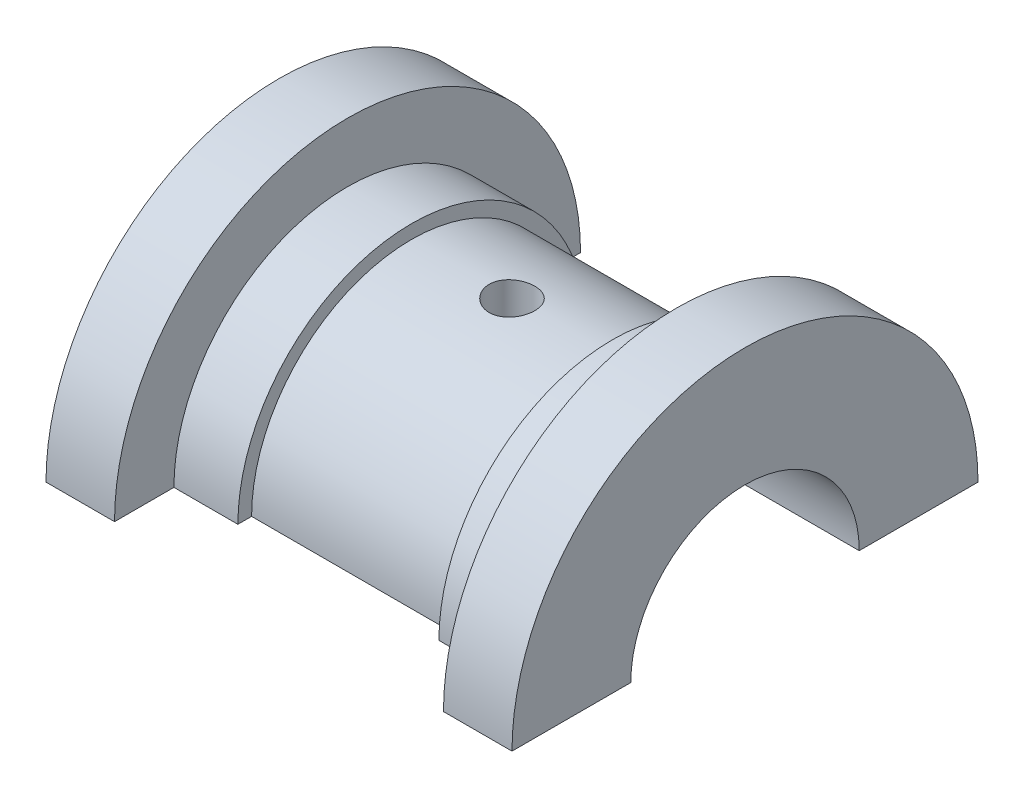
ISO-10303-21;
HEADER;
FILE_DESCRIPTION(('STEP AP214'),'2;1');
FILE_NAME('part.step','',(''),(''),'','','');
FILE_SCHEMA(('AUTOMOTIVE_DESIGN { 1 0 10303 214 1 1 1 1 }'));
ENDSEC;
DATA;
#1=APPLICATION_CONTEXT('core data for automotive mechanical design processes');
#2=APPLICATION_PROTOCOL_DEFINITION('international standard','automotive_design',2000,#1);
#3=PRODUCT_CONTEXT('',#1,'mechanical');
#4=PRODUCT('Part','Part','',(#3));
#5=PRODUCT_RELATED_PRODUCT_CATEGORY('part','',(#4));
#6=PRODUCT_DEFINITION_FORMATION('','',#4);
#7=PRODUCT_DEFINITION_CONTEXT('part definition',#1,'design');
#8=PRODUCT_DEFINITION('design','',#6,#7);
#9=PRODUCT_DEFINITION_SHAPE('','',#8);
#10=(LENGTH_UNIT() NAMED_UNIT(*) SI_UNIT(.MILLI.,.METRE.));
#11=(NAMED_UNIT(*) PLANE_ANGLE_UNIT() SI_UNIT($,.RADIAN.));
#12=(NAMED_UNIT(*) SI_UNIT($,.STERADIAN.) SOLID_ANGLE_UNIT());
#13=UNCERTAINTY_MEASURE_WITH_UNIT(LENGTH_MEASURE(1.E-05),#10,'distance_accuracy_value','');
#14=(GEOMETRIC_REPRESENTATION_CONTEXT(3) GLOBAL_UNCERTAINTY_ASSIGNED_CONTEXT((#13)) GLOBAL_UNIT_ASSIGNED_CONTEXT((#10,
#11,#12)) REPRESENTATION_CONTEXT('',''));
#15=CARTESIAN_POINT('',(0.,0.,0.));
#16=DIRECTION('',(0.,0.,1.));
#17=DIRECTION('',(1.,0.,0.));
#18=AXIS2_PLACEMENT_3D('',#15,#16,#17);
#19=CARTESIAN_POINT('',(25.5,0.,12.5));
#20=DIRECTION('',(-1.,0.,0.));
#21=DIRECTION('',(0.,0.,1.));
#22=AXIS2_PLACEMENT_3D('',#19,#20,#21);
#23=PLANE('',#22);
#24=CARTESIAN_POINT('',(25.5,0.,0.));
#25=DIRECTION('',(-1.,0.,0.));
#26=DIRECTION('',(0.,0.,1.));
#27=AXIS2_PLACEMENT_3D('',#24,#25,#26);
#28=CIRCLE('',#27,25.5);
#29=CARTESIAN_POINT('',(25.5,0.,25.5));
#30=VERTEX_POINT('',#29);
#31=CARTESIAN_POINT('',(25.5,0.,-25.5));
#32=VERTEX_POINT('',#31);
#33=EDGE_CURVE('E45',#30,#32,#28,.T.);
#34=ORIENTED_EDGE('',*,*,#33,.F.);
#35=DIRECTION('',(0.,0.,1.));
#36=VECTOR('',#35,1.);
#37=CARTESIAN_POINT('',(25.5,0.,12.5));
#38=LINE('',#37,#36);
#39=CARTESIAN_POINT('',(25.5,0.,12.5));
#40=VERTEX_POINT('',#39);
#41=EDGE_CURVE('E176',#40,#30,#38,.T.);
#42=ORIENTED_EDGE('',*,*,#41,.F.);
#43=CARTESIAN_POINT('',(25.5,0.,0.));
#44=DIRECTION('',(-1.,0.,0.));
#45=DIRECTION('',(0.,0.,1.));
#46=AXIS2_PLACEMENT_3D('',#43,#44,#45);
#47=CIRCLE('',#46,12.5);
#48=CARTESIAN_POINT('',(25.5,0.,-12.5));
#49=VERTEX_POINT('',#48);
#50=EDGE_CURVE('E52',#40,#49,#47,.T.);
#51=ORIENTED_EDGE('',*,*,#50,.T.);
#52=DIRECTION('',(0.,0.,-1.));
#53=VECTOR('',#52,1.);
#54=CARTESIAN_POINT('',(25.5,0.,-12.5));
#55=LINE('',#54,#53);
#56=EDGE_CURVE('E138',#49,#32,#55,.T.);
#57=ORIENTED_EDGE('',*,*,#56,.T.);
#58=EDGE_LOOP('',(#34,#42,#51,#57));
#59=FACE_BOUND('',#58,.T.);
#60=ADVANCED_FACE('F33',(#59),#23,.F.);
#61=CARTESIAN_POINT('',(0.,0.,0.));
#62=DIRECTION('',(-1.,0.,0.));
#63=DIRECTION('',(0.,0.,1.));
#64=AXIS2_PLACEMENT_3D('',#61,#62,#63);
#65=CYLINDRICAL_SURFACE('',#64,25.5);
#66=CARTESIAN_POINT('',(18.,0.,0.));
#67=DIRECTION('',(-1.,0.,0.));
#68=DIRECTION('',(0.,0.,1.));
#69=AXIS2_PLACEMENT_3D('',#66,#67,#68);
#70=CIRCLE('',#69,25.5);
#71=CARTESIAN_POINT('',(18.,0.,25.5));
#72=VERTEX_POINT('',#71);
#73=CARTESIAN_POINT('',(18.,0.,-25.5));
#74=VERTEX_POINT('',#73);
#75=EDGE_CURVE('E136',#72,#74,#70,.T.);
#76=ORIENTED_EDGE('',*,*,#75,.F.);
#77=DIRECTION('',(-1.,0.,0.));
#78=VECTOR('',#77,1.);
#79=CARTESIAN_POINT('',(25.5,0.,25.5));
#80=LINE('',#79,#78);
#81=EDGE_CURVE('E133',#30,#72,#80,.T.);
#82=ORIENTED_EDGE('',*,*,#81,.F.);
#83=ORIENTED_EDGE('',*,*,#33,.T.);
#84=DIRECTION('',(-1.,0.,0.));
#85=VECTOR('',#84,1.);
#86=CARTESIAN_POINT('',(25.5,0.,-25.5));
#87=LINE('',#86,#85);
#88=EDGE_CURVE('E130',#32,#74,#87,.T.);
#89=ORIENTED_EDGE('',*,*,#88,.T.);
#90=EDGE_LOOP('',(#76,#82,#83,#89));
#91=FACE_BOUND('',#90,.T.);
#92=ADVANCED_FACE('F35',(#91),#65,.T.);
#93=CARTESIAN_POINT('',(18.,0.,25.5));
#94=DIRECTION('',(1.,0.,0.));
#95=DIRECTION('',(0.,0.,-1.));
#96=AXIS2_PLACEMENT_3D('',#93,#94,#95);
#97=PLANE('',#96);
#98=CARTESIAN_POINT('',(18.,0.,0.));
#99=DIRECTION('',(-1.,0.,0.));
#100=DIRECTION('',(0.,0.,1.));
#101=AXIS2_PLACEMENT_3D('',#98,#99,#100);
#102=CIRCLE('',#101,19.);
#103=CARTESIAN_POINT('',(18.,0.,19.));
#104=VERTEX_POINT('',#103);
#105=CARTESIAN_POINT('',(18.,0.,-19.));
#106=VERTEX_POINT('',#105);
#107=EDGE_CURVE('E224',#104,#106,#102,.T.);
#108=ORIENTED_EDGE('',*,*,#107,.F.);
#109=DIRECTION('',(0.,0.,-1.));
#110=VECTOR('',#109,1.);
#111=CARTESIAN_POINT('',(18.,0.,25.5));
#112=LINE('',#111,#110);
#113=EDGE_CURVE('E179',#72,#104,#112,.T.);
#114=ORIENTED_EDGE('',*,*,#113,.F.);
#115=ORIENTED_EDGE('',*,*,#75,.T.);
#116=DIRECTION('',(0.,0.,1.));
#117=VECTOR('',#116,1.);
#118=CARTESIAN_POINT('',(18.,0.,-25.5));
#119=LINE('',#118,#117);
#120=EDGE_CURVE('E146',#74,#106,#119,.T.);
#121=ORIENTED_EDGE('',*,*,#120,.T.);
#122=EDGE_LOOP('',(#108,#114,#115,#121));
#123=FACE_BOUND('',#122,.T.);
#124=ADVANCED_FACE('F228',(#123),#97,.F.);
#125=CARTESIAN_POINT('',(0.,0.,0.));
#126=DIRECTION('',(-1.,0.,0.));
#127=DIRECTION('',(0.,0.,1.));
#128=AXIS2_PLACEMENT_3D('',#125,#126,#127);
#129=CYLINDRICAL_SURFACE('',#128,19.);
#130=CARTESIAN_POINT('',(11.,0.,0.));
#131=DIRECTION('',(-1.,0.,0.));
#132=DIRECTION('',(0.,0.,1.));
#133=AXIS2_PLACEMENT_3D('',#130,#131,#132);
#134=CIRCLE('',#133,19.);
#135=CARTESIAN_POINT('',(11.,0.,19.));
#136=VERTEX_POINT('',#135);
#137=CARTESIAN_POINT('',(11.,0.,-19.));
#138=VERTEX_POINT('',#137);
#139=EDGE_CURVE('E222',#136,#138,#134,.T.);
#140=ORIENTED_EDGE('',*,*,#139,.F.);
#141=DIRECTION('',(-1.,0.,0.));
#142=VECTOR('',#141,1.);
#143=CARTESIAN_POINT('',(18.,0.,19.));
#144=LINE('',#143,#142);
#145=EDGE_CURVE('E182',#104,#136,#144,.T.);
#146=ORIENTED_EDGE('',*,*,#145,.F.);
#147=ORIENTED_EDGE('',*,*,#107,.T.);
#148=DIRECTION('',(-1.,0.,0.));
#149=VECTOR('',#148,1.);
#150=CARTESIAN_POINT('',(18.,0.,-19.));
#151=LINE('',#150,#149);
#152=EDGE_CURVE('E148',#106,#138,#151,.T.);
#153=ORIENTED_EDGE('',*,*,#152,.T.);
#154=EDGE_LOOP('',(#140,#146,#147,#153));
#155=FACE_BOUND('',#154,.T.);
#156=ADVANCED_FACE('F260',(#155),#129,.T.);
#157=CARTESIAN_POINT('',(11.,0.,19.));
#158=DIRECTION('',(1.,0.,0.));
#159=DIRECTION('',(0.,0.,-1.));
#160=AXIS2_PLACEMENT_3D('',#157,#158,#159);
#161=PLANE('',#160);
#162=CARTESIAN_POINT('',(11.,0.,0.));
#163=DIRECTION('',(-1.,0.,0.));
#164=DIRECTION('',(0.,0.,1.));
#165=AXIS2_PLACEMENT_3D('',#162,#163,#164);
#166=CIRCLE('',#165,17.5);
#167=CARTESIAN_POINT('',(11.,0.,17.5));
#168=VERTEX_POINT('',#167);
#169=CARTESIAN_POINT('',(11.,0.,-17.5));
#170=VERTEX_POINT('',#169);
#171=EDGE_CURVE('E220',#168,#170,#166,.T.);
#172=ORIENTED_EDGE('',*,*,#171,.F.);
#173=DIRECTION('',(0.,0.,-1.));
#174=VECTOR('',#173,1.);
#175=CARTESIAN_POINT('',(11.,0.,19.));
#176=LINE('',#175,#174);
#177=EDGE_CURVE('E185',#136,#168,#176,.T.);
#178=ORIENTED_EDGE('',*,*,#177,.F.);
#179=ORIENTED_EDGE('',*,*,#139,.T.);
#180=DIRECTION('',(0.,0.,1.));
#181=VECTOR('',#180,1.);
#182=CARTESIAN_POINT('',(11.,0.,-19.));
#183=LINE('',#182,#181);
#184=EDGE_CURVE('E154',#138,#170,#183,.T.);
#185=ORIENTED_EDGE('',*,*,#184,.T.);
#186=EDGE_LOOP('',(#172,#178,#179,#185));
#187=FACE_BOUND('',#186,.T.);
#188=ADVANCED_FACE('F258',(#187),#161,.F.);
#189=CARTESIAN_POINT('',(0.,0.,0.));
#190=DIRECTION('',(-1.,0.,0.));
#191=DIRECTION('',(0.,0.,1.));
#192=AXIS2_PLACEMENT_3D('',#189,#190,#191);
#193=CYLINDRICAL_SURFACE('',#192,17.5);
#194=CARTESIAN_POINT('',(0.,17.3205080756888,2.49999999999999));
#195=CARTESIAN_POINT('',(-0.139655214050539,17.3205103214296,2.49999417644979));
#196=CARTESIAN_POINT('',(-0.279393390965434,17.3222153996634,2.48825830633599));
#197=CARTESIAN_POINT('',(-0.554968295528884,17.3288474891277,2.44163425172346));
#198=CARTESIAN_POINT('',(-0.690800994393875,17.3337777110364,2.40672299527127));
#199=CARTESIAN_POINT('',(-0.954535875036128,17.346290533042,2.31480923545586));
#200=CARTESIAN_POINT('',(-1.08244384762566,17.3538711688453,2.25782308902599));
#201=CARTESIAN_POINT('',(-1.32686216183505,17.3708283324759,2.12341469861512));
#202=CARTESIAN_POINT('',(-1.44337418380036,17.3802045949313,2.04599547375905));
#203=CARTESIAN_POINT('',(-1.66256036980916,17.3997728156945,1.87231683550245));
#204=CARTESIAN_POINT('',(-1.76513964233235,17.4099696809091,1.77593820534161));
#205=CARTESIAN_POINT('',(-1.95272694655072,17.4299862889805,1.56733384870893));
#206=CARTESIAN_POINT('',(-2.03773404080033,17.4398060116945,1.4551072773139));
#207=CARTESIAN_POINT('',(-2.1881113721996,17.4580129627861,1.21738798002561));
#208=CARTESIAN_POINT('',(-2.25339464314803,17.4663937786684,1.09183970777011));
#209=CARTESIAN_POINT('',(-2.36191341915977,17.4807243931613,0.831420932453866));
#210=CARTESIAN_POINT('',(-2.40514998330923,17.4866743085456,0.696550877549158));
#211=CARTESIAN_POINT('',(-2.46806150870533,17.4954381251123,0.422292579426186));
#212=CARTESIAN_POINT('',(-2.48789508745779,17.4982731289764,0.282941406337346));
#213=CARTESIAN_POINT('',(-2.50392987320824,17.5005599435479,0.00286195659799773));
#214=CARTESIAN_POINT('',(-2.50013227745763,17.5000119256529,-0.137866249925724));
#215=CARTESIAN_POINT('',(-2.46913827723022,17.4956113682908,-0.415623740232337));
#216=CARTESIAN_POINT('',(-2.44211250139685,17.4917829266554,-0.552672499713792));
#217=CARTESIAN_POINT('',(-2.36569680037598,17.4812785676579,-0.820269493910865));
#218=CARTESIAN_POINT('',(-2.31630634376524,17.4746025826336,-0.950817574077351));
#219=CARTESIAN_POINT('',(-2.19638656902053,17.4591117546373,-1.20222745845967));
#220=CARTESIAN_POINT('',(-2.12578481110144,17.4502896021464,-1.32305424098883));
#221=CARTESIAN_POINT('',(-1.96549938407466,17.4314908337029,-1.55120977517205));
#222=CARTESIAN_POINT('',(-1.87581457419597,17.4215141487494,-1.65853771926478));
#223=CARTESIAN_POINT('',(-1.678956747905,17.4014150617975,-1.85765373882982));
#224=CARTESIAN_POINT('',(-1.5716348340635,17.3912921538904,-1.94929461665229));
#225=CARTESIAN_POINT('',(-1.34305684821314,17.3721286734458,-2.11328736987653));
#226=CARTESIAN_POINT('',(-1.22180070481798,17.3630881064538,-2.18563914645222));
#227=CARTESIAN_POINT('',(-0.968649637617271,17.3471131710366,-2.30901626900993));
#228=CARTESIAN_POINT('',(-0.836747742646741,17.3401801971233,-2.36002750314722));
#229=CARTESIAN_POINT('',(-0.566128025217638,17.3292308226119,-2.43913279635399));
#230=CARTESIAN_POINT('',(-0.427410637010545,17.3252142364516,-2.46722831350377));
#231=CARTESIAN_POINT('',(-0.148404328212449,17.3205872594665,-2.49950488360241));
#232=CARTESIAN_POINT('',(-0.00813996750551849,17.3199472150388,-2.50389413880589));
#233=CARTESIAN_POINT('',(0.271122256281439,17.3220671566589,-2.489185103089));
#234=CARTESIAN_POINT('',(0.410120154779111,17.3248270473289,-2.47008747104211));
#235=CARTESIAN_POINT('',(0.682265225035557,17.3334087065645,-2.40912297319001));
#236=CARTESIAN_POINT('',(0.815435908831675,17.3392166418156,-2.36735894805525));
#237=CARTESIAN_POINT('',(1.07288599682062,17.3532286401521,-2.26235382714328));
#238=CARTESIAN_POINT('',(1.19716499945215,17.3614328113701,-2.19911176212675));
#239=CARTESIAN_POINT('',(1.43423984965186,17.3793831051677,-2.05244200414031));
#240=CARTESIAN_POINT('',(1.54695120151544,17.3891394056538,-1.96887900033905));
#241=CARTESIAN_POINT('',(1.75682465453188,17.4090636358241,-1.78412847276705));
#242=CARTESIAN_POINT('',(1.8539859600739,17.4192315865368,-1.6829400477527));
#243=CARTESIAN_POINT('',(2.03074402304224,17.4389256551739,-1.46489635785668));
#244=CARTESIAN_POINT('',(2.1102031528994,17.4484463695232,-1.3479289651554));
#245=CARTESIAN_POINT('',(2.24834445391964,17.4656902694975,-1.10218588096399));
#246=CARTESIAN_POINT('',(2.30702714967243,17.4734135005061,-0.973410487720562));
#247=CARTESIAN_POINT('',(2.40172764289464,17.4861684730555,-0.70814490574241));
#248=CARTESIAN_POINT('',(2.43782198578435,17.4912092957152,-0.571682498904907));
#249=CARTESIAN_POINT('',(2.48656933388325,17.4980694889566,-0.294556573807227));
#250=CARTESIAN_POINT('',(2.4992237373173,17.4998890516906,-0.153893306642842));
#251=CARTESIAN_POINT('',(2.50070029868058,17.5001000958988,0.126303913283945));
#252=CARTESIAN_POINT('',(2.48973352377306,17.4985219377795,0.26583677718822));
#253=CARTESIAN_POINT('',(2.44472981244618,17.4921758034385,0.54105329184985));
#254=CARTESIAN_POINT('',(2.41069293049507,17.4874078347479,0.676736951694341));
#255=CARTESIAN_POINT('',(2.32058752821483,17.4752152756766,0.940354643121522));
#256=CARTESIAN_POINT('',(2.26453227439437,17.4677922852398,1.06829328775858));
#257=CARTESIAN_POINT('',(2.13200356349716,17.4511070012847,1.31298213231449));
#258=CARTESIAN_POINT('',(2.05552956867623,17.4418446593271,1.42973203745873));
#259=CARTESIAN_POINT('',(1.88356535597191,17.4224130932707,1.64980243700276));
#260=CARTESIAN_POINT('',(1.78791886646362,17.4122368231533,1.75300020789776));
#261=CARTESIAN_POINT('',(1.58065304970162,17.3921777929122,1.94195895909258));
#262=CARTESIAN_POINT('',(1.46902997123846,17.3822951023791,2.02771583289178));
#263=CARTESIAN_POINT('',(1.23231820209395,17.3638885978291,2.17974404343877));
#264=CARTESIAN_POINT('',(1.10716413704061,17.3553719241531,2.24591442873637));
#265=CARTESIAN_POINT('',(0.847459629299104,17.3407453505435,2.35619878131272));
#266=CARTESIAN_POINT('',(0.712919252117546,17.3346329177213,2.40033597402072));
#267=CARTESIAN_POINT('',(0.481454467704518,17.3269411528972,2.45511568957329));
#268=CARTESIAN_POINT('',(0.385969580734812,17.3245412999151,2.47192203162012));
#269=CARTESIAN_POINT('',(0.19366975379469,17.3213239914062,2.49436614385581));
#270=CARTESIAN_POINT('',(0.096854828692965,17.3205065182042,2.50000403879625));
#271=CARTESIAN_POINT('',(0.,17.3205080756888,2.49999999999999));
#272=B_SPLINE_CURVE_WITH_KNOTS('',3,(#194,#195,#196,#197,#198,#199,#200,#201,#202,#203,#204,
#205,#206,#207,#208,#209,#210,#211,#212,#213,#214,#215,#216,#217,#218,#219,#220,#221,#222,#223,
#224,#225,#226,#227,#228,#229,#230,#231,#232,#233,#234,#235,#236,#237,#238,#239,#240,#241,#242,
#243,#244,#245,#246,#247,#248,#249,#250,#251,#252,#253,#254,#255,#256,#257,#258,#259,#260,#261,
#262,#263,#264,#265,#266,#267,#268,#269,#270,#271),.UNSPECIFIED.,.T.,.F.,(4,2,2,2,2,2,2,2,2,2,2,
2,2,2,2,2,2,2,2,2,2,2,2,2,2,2,2,2,2,2,2,2,2,2,2,2,2,2,4),(0.,0.418611686761215,
0.837640743157848,1.25635990174198,1.67501722635384,2.09639644561274,2.5177981389317,
2.94103163345003,3.36424479463774,3.78457277673271,4.20487946347622,4.622124811343,
5.03938007419637,5.45807684551731,5.87679865326297,6.29925647482801,6.72171646077844,
7.14445536663834,7.56716737238591,7.98616076353196,8.40514240099878,8.82223876005369,
9.23935394391402,9.65932651264325,10.0793205622075,10.502474019027,10.9256167907707,
11.3473177767363,11.7689936068437,12.1869171913008,12.6048397890487,13.022510965389,
13.4401931425248,13.8614293663582,14.2827646567286,14.7062351939403,15.1292583986303,
15.4195806495843,15.7098996576198),.UNSPECIFIED.);
#273=CARTESIAN_POINT('',(0.,17.3205080756888,2.49999999999999));
#274=VERTEX_POINT('',#273);
#275=EDGE_CURVE('E11',#274,#274,#272,.T.);
#276=ORIENTED_EDGE('',*,*,#275,.T.);
#277=EDGE_LOOP('',(#276));
#278=FACE_BOUND('',#277,.T.);
#279=CARTESIAN_POINT('',(-11.,0.,0.));
#280=DIRECTION('',(-1.,0.,0.));
#281=DIRECTION('',(0.,0.,1.));
#282=AXIS2_PLACEMENT_3D('',#279,#280,#281);
#283=CIRCLE('',#282,17.5);
#284=CARTESIAN_POINT('',(-11.,0.,17.5));
#285=VERTEX_POINT('',#284);
#286=CARTESIAN_POINT('',(-11.,0.,-17.5));
#287=VERTEX_POINT('',#286);
#288=EDGE_CURVE('E218',#285,#287,#283,.T.);
#289=ORIENTED_EDGE('',*,*,#288,.F.);
#290=DIRECTION('',(-1.,0.,0.));
#291=VECTOR('',#290,1.);
#292=CARTESIAN_POINT('',(11.,0.,17.5));
#293=LINE('',#292,#291);
#294=EDGE_CURVE('E188',#168,#285,#293,.T.);
#295=ORIENTED_EDGE('',*,*,#294,.F.);
#296=ORIENTED_EDGE('',*,*,#171,.T.);
#297=DIRECTION('',(-1.,0.,0.));
#298=VECTOR('',#297,1.);
#299=CARTESIAN_POINT('',(11.,0.,-17.5));
#300=LINE('',#299,#298);
#301=EDGE_CURVE('E157',#170,#287,#300,.T.);
#302=ORIENTED_EDGE('',*,*,#301,.T.);
#303=EDGE_LOOP('',(#289,#295,#296,#302));
#304=FACE_BOUND('',#303,.T.);
#305=ADVANCED_FACE('F255',(#278,#304),#193,.T.);
#306=CARTESIAN_POINT('',(-11.,0.,19.));
#307=DIRECTION('',(-1.,0.,0.));
#308=DIRECTION('',(0.,0.,1.));
#309=AXIS2_PLACEMENT_3D('',#306,#307,#308);
#310=PLANE('',#309);
#311=CARTESIAN_POINT('',(-11.,0.,0.));
#312=DIRECTION('',(-1.,0.,0.));
#313=DIRECTION('',(0.,0.,1.));
#314=AXIS2_PLACEMENT_3D('',#311,#312,#313);
#315=CIRCLE('',#314,19.);
#316=CARTESIAN_POINT('',(-11.,0.,19.));
#317=VERTEX_POINT('',#316);
#318=CARTESIAN_POINT('',(-11.,0.,-19.));
#319=VERTEX_POINT('',#318);
#320=EDGE_CURVE('E216',#317,#319,#315,.T.);
#321=ORIENTED_EDGE('',*,*,#320,.F.);
#322=DIRECTION('',(0.,0.,1.));
#323=VECTOR('',#322,1.);
#324=CARTESIAN_POINT('',(-11.,0.,19.));
#325=LINE('',#324,#323);
#326=EDGE_CURVE('E191',#285,#317,#325,.T.);
#327=ORIENTED_EDGE('',*,*,#326,.F.);
#328=ORIENTED_EDGE('',*,*,#288,.T.);
#329=DIRECTION('',(0.,0.,-1.));
#330=VECTOR('',#329,1.);
#331=CARTESIAN_POINT('',(-11.,0.,-19.));
#332=LINE('',#331,#330);
#333=EDGE_CURVE('E160',#287,#319,#332,.T.);
#334=ORIENTED_EDGE('',*,*,#333,.T.);
#335=EDGE_LOOP('',(#321,#327,#328,#334));
#336=FACE_BOUND('',#335,.T.);
#337=ADVANCED_FACE('F251',(#336),#310,.F.);
#338=CARTESIAN_POINT('',(0.,0.,0.));
#339=DIRECTION('',(-1.,0.,0.));
#340=DIRECTION('',(0.,0.,1.));
#341=AXIS2_PLACEMENT_3D('',#338,#339,#340);
#342=CYLINDRICAL_SURFACE('',#341,19.);
#343=CARTESIAN_POINT('',(-18.,0.,0.));
#344=DIRECTION('',(-1.,0.,0.));
#345=DIRECTION('',(0.,0.,1.));
#346=AXIS2_PLACEMENT_3D('',#343,#344,#345);
#347=CIRCLE('',#346,19.);
#348=CARTESIAN_POINT('',(-18.,0.,19.));
#349=VERTEX_POINT('',#348);
#350=CARTESIAN_POINT('',(-18.,0.,-19.));
#351=VERTEX_POINT('',#350);
#352=EDGE_CURVE('E214',#349,#351,#347,.T.);
#353=ORIENTED_EDGE('',*,*,#352,.F.);
#354=DIRECTION('',(-1.,0.,0.));
#355=VECTOR('',#354,1.);
#356=CARTESIAN_POINT('',(-18.,0.,19.));
#357=LINE('',#356,#355);
#358=EDGE_CURVE('E194',#317,#349,#357,.T.);
#359=ORIENTED_EDGE('',*,*,#358,.F.);
#360=ORIENTED_EDGE('',*,*,#320,.T.);
#361=DIRECTION('',(-1.,0.,0.));
#362=VECTOR('',#361,1.);
#363=CARTESIAN_POINT('',(-18.,0.,-19.));
#364=LINE('',#363,#362);
#365=EDGE_CURVE('E163',#319,#351,#364,.T.);
#366=ORIENTED_EDGE('',*,*,#365,.T.);
#367=EDGE_LOOP('',(#353,#359,#360,#366));
#368=FACE_BOUND('',#367,.T.);
#369=ADVANCED_FACE('F246',(#368),#342,.T.);
#370=CARTESIAN_POINT('',(-18.,0.,25.5));
#371=DIRECTION('',(-1.,0.,0.));
#372=DIRECTION('',(0.,0.,1.));
#373=AXIS2_PLACEMENT_3D('',#370,#371,#372);
#374=PLANE('',#373);
#375=CARTESIAN_POINT('',(-18.,0.,0.));
#376=DIRECTION('',(-1.,0.,0.));
#377=DIRECTION('',(0.,0.,1.));
#378=AXIS2_PLACEMENT_3D('',#375,#376,#377);
#379=CIRCLE('',#378,25.5);
#380=CARTESIAN_POINT('',(-18.,0.,25.5));
#381=VERTEX_POINT('',#380);
#382=CARTESIAN_POINT('',(-18.,0.,-25.5));
#383=VERTEX_POINT('',#382);
#384=EDGE_CURVE('E212',#381,#383,#379,.T.);
#385=ORIENTED_EDGE('',*,*,#384,.F.);
#386=DIRECTION('',(0.,0.,1.));
#387=VECTOR('',#386,1.);
#388=CARTESIAN_POINT('',(-18.,0.,25.5));
#389=LINE('',#388,#387);
#390=EDGE_CURVE('E197',#349,#381,#389,.T.);
#391=ORIENTED_EDGE('',*,*,#390,.F.);
#392=ORIENTED_EDGE('',*,*,#352,.T.);
#393=DIRECTION('',(0.,0.,-1.));
#394=VECTOR('',#393,1.);
#395=CARTESIAN_POINT('',(-18.,0.,-25.5));
#396=LINE('',#395,#394);
#397=EDGE_CURVE('E166',#351,#383,#396,.T.);
#398=ORIENTED_EDGE('',*,*,#397,.T.);
#399=EDGE_LOOP('',(#385,#391,#392,#398));
#400=FACE_BOUND('',#399,.T.);
#401=ADVANCED_FACE('F243',(#400),#374,.F.);
#402=CARTESIAN_POINT('',(0.,0.,0.));
#403=DIRECTION('',(-1.,0.,0.));
#404=DIRECTION('',(0.,0.,1.));
#405=AXIS2_PLACEMENT_3D('',#402,#403,#404);
#406=CYLINDRICAL_SURFACE('',#405,25.5);
#407=CARTESIAN_POINT('',(-25.5,0.,0.));
#408=DIRECTION('',(-1.,0.,0.));
#409=DIRECTION('',(0.,0.,1.));
#410=AXIS2_PLACEMENT_3D('',#407,#408,#409);
#411=CIRCLE('',#410,25.5);
#412=CARTESIAN_POINT('',(-25.5,0.,25.5));
#413=VERTEX_POINT('',#412);
#414=CARTESIAN_POINT('',(-25.5,0.,-25.5));
#415=VERTEX_POINT('',#414);
#416=EDGE_CURVE('E210',#413,#415,#411,.T.);
#417=ORIENTED_EDGE('',*,*,#416,.F.);
#418=DIRECTION('',(-1.,0.,0.));
#419=VECTOR('',#418,1.);
#420=CARTESIAN_POINT('',(-25.5,0.,25.5));
#421=LINE('',#420,#419);
#422=EDGE_CURVE('E200',#381,#413,#421,.T.);
#423=ORIENTED_EDGE('',*,*,#422,.F.);
#424=ORIENTED_EDGE('',*,*,#384,.T.);
#425=DIRECTION('',(-1.,0.,0.));
#426=VECTOR('',#425,1.);
#427=CARTESIAN_POINT('',(-25.5,0.,-25.5));
#428=LINE('',#427,#426);
#429=EDGE_CURVE('E169',#383,#415,#428,.T.);
#430=ORIENTED_EDGE('',*,*,#429,.T.);
#431=EDGE_LOOP('',(#417,#423,#424,#430));
#432=FACE_BOUND('',#431,.T.);
#433=ADVANCED_FACE('F239',(#432),#406,.T.);
#434=CARTESIAN_POINT('',(-25.5,0.,12.5));
#435=DIRECTION('',(1.,0.,0.));
#436=DIRECTION('',(0.,0.,-1.));
#437=AXIS2_PLACEMENT_3D('',#434,#435,#436);
#438=PLANE('',#437);
#439=CARTESIAN_POINT('',(-25.5,0.,0.));
#440=DIRECTION('',(-1.,0.,0.));
#441=DIRECTION('',(0.,0.,1.));
#442=AXIS2_PLACEMENT_3D('',#439,#440,#441);
#443=CIRCLE('',#442,12.5);
#444=CARTESIAN_POINT('',(-25.5,0.,12.5));
#445=VERTEX_POINT('',#444);
#446=CARTESIAN_POINT('',(-25.5,0.,-12.5));
#447=VERTEX_POINT('',#446);
#448=EDGE_CURVE('E60',#445,#447,#443,.T.);
#449=ORIENTED_EDGE('',*,*,#448,.F.);
#450=DIRECTION('',(0.,0.,-1.));
#451=VECTOR('',#450,1.);
#452=CARTESIAN_POINT('',(-25.5,0.,12.5));
#453=LINE('',#452,#451);
#454=EDGE_CURVE('E203',#413,#445,#453,.T.);
#455=ORIENTED_EDGE('',*,*,#454,.F.);
#456=ORIENTED_EDGE('',*,*,#416,.T.);
#457=DIRECTION('',(0.,0.,1.));
#458=VECTOR('',#457,1.);
#459=CARTESIAN_POINT('',(-25.5,0.,-12.5));
#460=LINE('',#459,#458);
#461=EDGE_CURVE('E172',#415,#447,#460,.T.);
#462=ORIENTED_EDGE('',*,*,#461,.T.);
#463=EDGE_LOOP('',(#449,#455,#456,#462));
#464=FACE_BOUND('',#463,.T.);
#465=ADVANCED_FACE('F234',(#464),#438,.F.);
#466=CARTESIAN_POINT('',(0.,0.,0.));
#467=DIRECTION('',(-1.,0.,0.));
#468=DIRECTION('',(0.,0.,1.));
#469=AXIS2_PLACEMENT_3D('',#466,#467,#468);
#470=CYLINDRICAL_SURFACE('',#469,12.5);
#471=CARTESIAN_POINT('',(0.,12.2474487139159,2.49999999999999));
#472=CARTESIAN_POINT('',(0.138910938727889,12.2474514756662,2.49999486468817));
#473=CARTESIAN_POINT('',(0.277886558333349,12.2498377067175,2.48838292929535));
#474=CARTESIAN_POINT('',(0.551906262857827,12.2591107826219,2.44228070895709));
#475=CARTESIAN_POINT('',(0.686947111589947,12.2660012286197,2.40777211767622));
#476=CARTESIAN_POINT('',(0.949093258385524,12.2834718430464,2.31698945654935));
#477=CARTESIAN_POINT('',(1.07620630383147,12.2940483405269,2.26073703538154));
#478=CARTESIAN_POINT('',(1.31918711174238,12.3176949870165,2.12812276917625));
#479=CARTESIAN_POINT('',(1.43505550134475,12.3307649968365,2.05176204650287));
#480=CARTESIAN_POINT('',(1.65390250963465,12.3581324923563,1.87994768913358));
#481=CARTESIAN_POINT('',(1.75669896970992,12.3724434459312,1.78426413978329));
#482=CARTESIAN_POINT('',(1.94489383394744,12.400561807565,1.57701697255327));
#483=CARTESIAN_POINT('',(2.03029101854297,12.4143691802708,1.46545224244495));
#484=CARTESIAN_POINT('',(2.18197004407114,12.4400699104391,1.22840338981063));
#485=CARTESIAN_POINT('',(2.24807878454159,12.4519455360388,1.10280641918052));
#486=CARTESIAN_POINT('',(2.35818734262033,12.4722934220908,0.842010375968174));
#487=CARTESIAN_POINT('',(2.40218922975247,12.480766001103,0.706812203551379));
#488=CARTESIAN_POINT('',(2.46626798404905,12.4932580172105,0.432541933196234));
#489=CARTESIAN_POINT('',(2.48665244392751,12.4973346572032,0.293544348037033));
#490=CARTESIAN_POINT('',(2.50387737959578,12.5007730295901,0.0140464210938404));
#491=CARTESIAN_POINT('',(2.50072012411454,12.500135216319,-0.126453774579608));
#492=CARTESIAN_POINT('',(2.4711845494611,12.4942608717129,-0.40285500185897));
#493=CARTESIAN_POINT('',(2.44513755708037,12.489089959146,-0.538793035746173));
#494=CARTESIAN_POINT('',(2.37108741885276,12.4748044289852,-0.80432906645075));
#495=CARTESIAN_POINT('',(2.32308339452031,12.465689653601,-0.933926809367819));
#496=CARTESIAN_POINT('',(2.20617489963182,12.444432400499,-1.18404865800221));
#497=CARTESIAN_POINT('',(2.13714062223777,12.4322712043806,-1.30451043533474));
#498=CARTESIAN_POINT('',(1.98022730690849,12.4062617368446,-1.53226261464938));
#499=CARTESIAN_POINT('',(1.8923461005737,12.3924132713806,-1.6395514988125));
#500=CARTESIAN_POINT('',(1.69841594472881,12.3642741091115,-1.83987857763364));
#501=CARTESIAN_POINT('',(1.59207703317602,12.3499799114379,-1.93263579143407));
#502=CARTESIAN_POINT('',(1.36520889387311,12.322789289969,-2.09904623294201));
#503=CARTESIAN_POINT('',(1.24467939779201,12.3098928926137,-2.17269909931937));
#504=CARTESIAN_POINT('',(0.992447920445483,12.2869511868231,-2.29890703700469));
#505=CARTESIAN_POINT('',(0.860722580900841,12.2769120390887,-2.35141661944426));
#506=CARTESIAN_POINT('',(0.590071690690018,12.2609119080318,-2.43347585406894));
#507=CARTESIAN_POINT('',(0.451147080952287,12.2549503932107,-2.4630284986416));
#508=CARTESIAN_POINT('',(0.172587855002387,12.2478869816957,-2.49791501509012));
#509=CARTESIAN_POINT('',(0.0330060642241482,12.2467036764289,-2.50365464724477));
#510=CARTESIAN_POINT('',(-0.245120557999208,12.2491121422214,-2.49184407077684));
#511=CARTESIAN_POINT('',(-0.383665447797157,12.2527036425097,-2.4742951828061));
#512=CARTESIAN_POINT('',(-0.654421600730586,12.2641808123729,-2.41675552018538));
#513=CARTESIAN_POINT('',(-0.786680857589405,12.2720249753624,-2.37698155209824));
#514=CARTESIAN_POINT('',(-1.04265819757185,12.2910872337916,-2.27635258827128));
#515=CARTESIAN_POINT('',(-1.1663755760893,12.3023056071567,-2.21549585593293));
#516=CARTESIAN_POINT('',(-1.4035327748754,12.327035149051,-2.07351035553899));
#517=CARTESIAN_POINT('',(-1.51681761575206,12.3405742966226,-1.99212769495688));
#518=CARTESIAN_POINT('',(-1.72827078000228,12.3683430956659,-1.81173893053177));
#519=CARTESIAN_POINT('',(-1.82643754562313,12.3825728180955,-1.71273101286134));
#520=CARTESIAN_POINT('',(-2.00640639796393,12.4103836467304,-1.49808068374472));
#521=CARTESIAN_POINT('',(-2.08793413662498,12.4239514427171,-1.38220624732407));
#522=CARTESIAN_POINT('',(-2.23036470374895,12.4486781907155,-1.13816974158688));
#523=CARTESIAN_POINT('',(-2.29126839836194,12.4598372438803,-1.01000818858376));
#524=CARTESIAN_POINT('',(-2.39032217936658,12.4784323515267,-0.745756702060028));
#525=CARTESIAN_POINT('',(-2.42860129556562,12.4858894785651,-0.609716683695192));
#526=CARTESIAN_POINT('',(-2.4817281191596,12.4963308984415,-0.332973636699777));
#527=CARTESIAN_POINT('',(-2.49657864868918,12.4993157299962,-0.192271171778028));
#528=CARTESIAN_POINT('',(-2.50231745240722,12.5004635113529,0.0871822347590532));
#529=CARTESIAN_POINT('',(-2.49361820114056,12.4987094637332,0.225924530353735));
#530=CARTESIAN_POINT('',(-2.45341512363042,12.4907510890085,0.499927578289124));
#531=CARTESIAN_POINT('',(-2.42191158412966,12.4845468178608,0.635188374384304));
#532=CARTESIAN_POINT('',(-2.33717751977102,12.468387459123,0.898131874362659));
#533=CARTESIAN_POINT('',(-2.28399655467255,12.4584409311904,1.02583110810041));
#534=CARTESIAN_POINT('',(-2.15746939667222,12.435868053092,1.27055305046517));
#535=CARTESIAN_POINT('',(-2.08412161023874,12.4232414911747,1.38757491441961));
#536=CARTESIAN_POINT('',(-1.91795153234678,12.3964399789185,1.60965972526478));
#537=CARTESIAN_POINT('',(-1.82483415904056,12.3822433354475,1.7144992902871));
#538=CARTESIAN_POINT('',(-1.62237439975307,12.3540305726966,1.90720654439626));
#539=CARTESIAN_POINT('',(-1.51302817630018,12.340014496968,1.99507020802228));
#540=CARTESIAN_POINT('',(-1.27980170827392,12.3135835683483,2.15223054862494));
#541=CARTESIAN_POINT('',(-1.15577759719686,12.3011875892806,2.22131703654522));
#542=CARTESIAN_POINT('',(-0.897668066849743,12.2796309281603,2.33756012316556));
#543=CARTESIAN_POINT('',(-0.763591903282021,12.2704673131246,2.3847366149354));
#544=CARTESIAN_POINT('',(-0.524343861392812,12.2582420284461,2.44667284964413));
#545=CARTESIAN_POINT('',(-0.420536451215103,12.2542196228652,2.4666347463092));
#546=CARTESIAN_POINT('',(-0.211165113622162,12.2488219614771,2.49330004489927));
#547=CARTESIAN_POINT('',(-0.105601246888828,12.2474466144105,2.5000039039066));
#548=CARTESIAN_POINT('',(0.,12.2474487139159,2.49999999999999));
#549=B_SPLINE_CURVE_WITH_KNOTS('',3,(#471,#472,#473,#474,#475,#476,#477,#478,#479,#480,#481,
#482,#483,#484,#485,#486,#487,#488,#489,#490,#491,#492,#493,#494,#495,#496,#497,#498,#499,#500,
#501,#502,#503,#504,#505,#506,#507,#508,#509,#510,#511,#512,#513,#514,#515,#516,#517,#518,#519,
#520,#521,#522,#523,#524,#525,#526,#527,#528,#529,#530,#531,#532,#533,#534,#535,#536,#537,#538,
#539,#540,#541,#542,#543,#544,#545,#546,#547,#548),.UNSPECIFIED.,.T.,.F.,(4,2,2,2,2,2,2,2,2,2,2,
2,2,2,2,2,2,2,2,2,2,2,2,2,2,2,2,2,2,2,2,2,2,2,2,2,2,2,4),(0.,0.416346159673568,
0.833025598210738,1.24929124485146,1.66553366214965,2.08705631371091,2.50860850088554,
2.93383501093624,3.35902170616398,3.77860622207699,4.19815030290619,4.61171974083842,
5.02530572684373,5.44149810555756,5.85773839425163,6.28123366906205,6.70473695306798,
7.12914657931938,7.55350087540059,7.9705939451148,8.3876633632105,8.80073354458293,
9.21383775885992,9.63232649436299,10.0508583217552,10.4758150433362,10.9007539157526,
11.3232453394662,11.7456858672906,12.1607754353671,12.5758597841689,12.9900004268862,
13.404173803367,13.8250288006399,14.2459834722445,14.6714724644901,15.0965743772549,
15.413095090954,15.7296048921369),.UNSPECIFIED.);
#550=CARTESIAN_POINT('',(0.,12.2474487139159,2.49999999999999));
#551=VERTEX_POINT('',#550);
#552=EDGE_CURVE('E141',#551,#551,#549,.T.);
#553=ORIENTED_EDGE('',*,*,#552,.T.);
#554=EDGE_LOOP('',(#553));
#555=FACE_BOUND('',#554,.T.);
#556=DIRECTION('',(1.,0.,0.));
#557=VECTOR('',#556,1.);
#558=CARTESIAN_POINT('',(-25.5,0.,12.5));
#559=LINE('',#558,#557);
#560=EDGE_CURVE('E205',#445,#40,#559,.T.);
#561=ORIENTED_EDGE('',*,*,#560,.F.);
#562=ORIENTED_EDGE('',*,*,#448,.T.);
#563=DIRECTION('',(1.,0.,0.));
#564=VECTOR('',#563,1.);
#565=CARTESIAN_POINT('',(-25.5,0.,-12.5));
#566=LINE('',#565,#564);
#567=EDGE_CURVE('E174',#447,#49,#566,.T.);
#568=ORIENTED_EDGE('',*,*,#567,.T.);
#569=ORIENTED_EDGE('',*,*,#50,.F.);
#570=EDGE_LOOP('',(#561,#562,#568,#569));
#571=FACE_BOUND('',#570,.T.);
#572=ADVANCED_FACE('F232',(#555,#571),#470,.F.);
#573=CARTESIAN_POINT('',(0.,0.,0.));
#574=DIRECTION('',(0.,-1.,0.));
#575=DIRECTION('',(1.,0.,0.));
#576=AXIS2_PLACEMENT_3D('',#573,#574,#575);
#577=PLANE('',#576);
#578=ORIENTED_EDGE('',*,*,#41,.T.);
#579=ORIENTED_EDGE('',*,*,#81,.T.);
#580=ORIENTED_EDGE('',*,*,#113,.T.);
#581=ORIENTED_EDGE('',*,*,#145,.T.);
#582=ORIENTED_EDGE('',*,*,#177,.T.);
#583=ORIENTED_EDGE('',*,*,#294,.T.);
#584=ORIENTED_EDGE('',*,*,#326,.T.);
#585=ORIENTED_EDGE('',*,*,#358,.T.);
#586=ORIENTED_EDGE('',*,*,#390,.T.);
#587=ORIENTED_EDGE('',*,*,#422,.T.);
#588=ORIENTED_EDGE('',*,*,#454,.T.);
#589=ORIENTED_EDGE('',*,*,#560,.T.);
#590=EDGE_LOOP('',(#578,#579,#580,#581,#582,#583,#584,#585,#586,#587,#588,#589));
#591=FACE_BOUND('',#590,.T.);
#592=ADVANCED_FACE('F230',(#591),#577,.T.);
#593=CARTESIAN_POINT('',(0.,0.,0.));
#594=DIRECTION('',(0.,1.,0.));
#595=DIRECTION('',(1.,0.,0.));
#596=AXIS2_PLACEMENT_3D('',#593,#594,#595);
#597=PLANE('',#596);
#598=ORIENTED_EDGE('',*,*,#56,.F.);
#599=ORIENTED_EDGE('',*,*,#567,.F.);
#600=ORIENTED_EDGE('',*,*,#461,.F.);
#601=ORIENTED_EDGE('',*,*,#429,.F.);
#602=ORIENTED_EDGE('',*,*,#397,.F.);
#603=ORIENTED_EDGE('',*,*,#365,.F.);
#604=ORIENTED_EDGE('',*,*,#333,.F.);
#605=ORIENTED_EDGE('',*,*,#301,.F.);
#606=ORIENTED_EDGE('',*,*,#184,.F.);
#607=ORIENTED_EDGE('',*,*,#152,.F.);
#608=ORIENTED_EDGE('',*,*,#120,.F.);
#609=ORIENTED_EDGE('',*,*,#88,.F.);
#610=EDGE_LOOP('',(#598,#599,#600,#601,#602,#603,#604,#605,#606,#607,#608,#609));
#611=FACE_BOUND('',#610,.T.);
#612=ADVANCED_FACE('F143',(#611),#597,.F.);
#613=CARTESIAN_POINT('',(0.,17.5,0.));
#614=DIRECTION('',(0.,1.,0.));
#615=DIRECTION('',(0.,0.,1.));
#616=AXIS2_PLACEMENT_3D('',#613,#614,#615);
#617=CYLINDRICAL_SURFACE('',#616,2.49999999999999);
#618=ORIENTED_EDGE('',*,*,#275,.F.);
#619=EDGE_LOOP('',(#618));
#620=FACE_BOUND('',#619,.T.);
#621=ORIENTED_EDGE('',*,*,#552,.F.);
#622=EDGE_LOOP('',(#621));
#623=FACE_BOUND('',#622,.T.);
#624=ADVANCED_FACE('F284',(#620,#623),#617,.F.);
#625=CLOSED_SHELL('',(#60,#92,#124,#156,#188,#305,#337,#369,#401,#433,#465,#572,#592,#612,#624));
#626=MANIFOLD_SOLID_BREP('B2',#625);
#627=ADVANCED_BREP_SHAPE_REPRESENTATION('',(#18,#626),#14);
#628=SHAPE_DEFINITION_REPRESENTATION(#9,#627);
ENDSEC;
END-ISO-10303-21;
